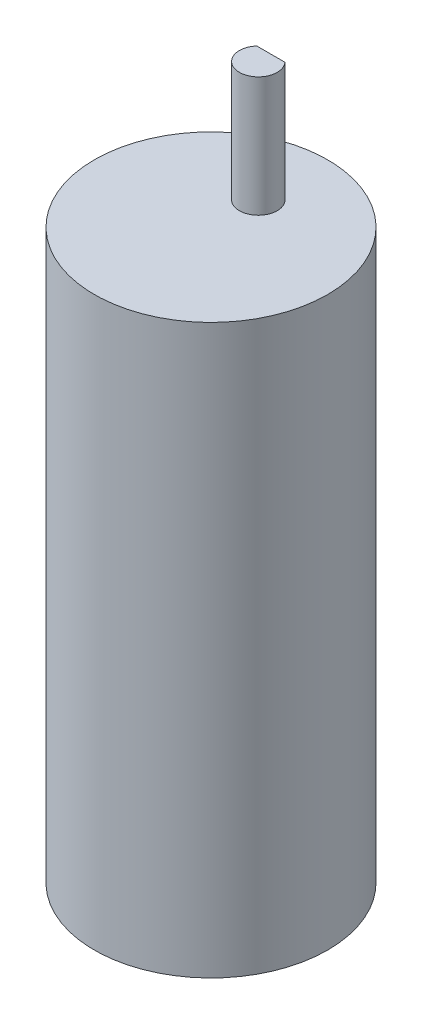
ISO-10303-21;
HEADER;
FILE_DESCRIPTION(('STEP AP214'),'2;1');
FILE_NAME('part.step','',(''),(''),'','','');
FILE_SCHEMA(('AUTOMOTIVE_DESIGN { 1 0 10303 214 1 1 1 1 }'));
ENDSEC;
DATA;
#1=APPLICATION_CONTEXT('core data for automotive mechanical design processes');
#2=APPLICATION_PROTOCOL_DEFINITION('international standard','automotive_design',2000,#1);
#3=PRODUCT_CONTEXT('',#1,'mechanical');
#4=PRODUCT('Part','Part','',(#3));
#5=PRODUCT_RELATED_PRODUCT_CATEGORY('part','',(#4));
#6=PRODUCT_DEFINITION_FORMATION('','',#4);
#7=PRODUCT_DEFINITION_CONTEXT('part definition',#1,'design');
#8=PRODUCT_DEFINITION('design','',#6,#7);
#9=PRODUCT_DEFINITION_SHAPE('','',#8);
#10=(LENGTH_UNIT() NAMED_UNIT(*) SI_UNIT(.MILLI.,.METRE.));
#11=(NAMED_UNIT(*) PLANE_ANGLE_UNIT() SI_UNIT($,.RADIAN.));
#12=(NAMED_UNIT(*) SI_UNIT($,.STERADIAN.) SOLID_ANGLE_UNIT());
#13=UNCERTAINTY_MEASURE_WITH_UNIT(LENGTH_MEASURE(1.E-05),#10,'distance_accuracy_value','');
#14=(GEOMETRIC_REPRESENTATION_CONTEXT(3) GLOBAL_UNCERTAINTY_ASSIGNED_CONTEXT((#13)) GLOBAL_UNIT_ASSIGNED_CONTEXT((#10,
#11,#12)) REPRESENTATION_CONTEXT('',''));
#15=CARTESIAN_POINT('',(0.,0.,0.));
#16=DIRECTION('',(0.,0.,1.));
#17=DIRECTION('',(1.,0.,0.));
#18=AXIS2_PLACEMENT_3D('',#15,#16,#17);
#19=CARTESIAN_POINT('',(0.,0.,0.));
#20=DIRECTION('',(0.,1.,0.));
#21=DIRECTION('',(-1.,0.,0.));
#22=AXIS2_PLACEMENT_3D('',#19,#20,#21);
#23=PLANE('',#22);
#24=CARTESIAN_POINT('',(0.,0.,0.));
#25=DIRECTION('',(0.,-1.,0.));
#26=DIRECTION('',(1.,0.,0.));
#27=AXIS2_PLACEMENT_3D('',#24,#25,#26);
#28=CIRCLE('',#27,18.5);
#29=CARTESIAN_POINT('',(18.5,0.,0.));
#30=VERTEX_POINT('',#29);
#31=EDGE_CURVE('E11',#30,#30,#28,.T.);
#32=ORIENTED_EDGE('',*,*,#31,.F.);
#33=EDGE_LOOP('',(#32));
#34=FACE_BOUND('',#33,.T.);
#35=DIRECTION('',(-1.,0.,0.));
#36=VECTOR('',#35,1.);
#37=CARTESIAN_POINT('',(-2.23606797749979,0.,-9.5));
#38=LINE('',#37,#36);
#39=CARTESIAN_POINT('',(2.23606797749979,0.,-9.5));
#40=VERTEX_POINT('',#39);
#41=CARTESIAN_POINT('',(-2.23606797749979,0.,-9.5));
#42=VERTEX_POINT('',#41);
#43=EDGE_CURVE('E61',#40,#42,#38,.T.);
#44=ORIENTED_EDGE('',*,*,#43,.F.);
#45=CARTESIAN_POINT('',(0.,0.,-7.5));
#46=DIRECTION('',(0.,1.,0.));
#47=DIRECTION('',(-1.,0.,0.));
#48=AXIS2_PLACEMENT_3D('',#45,#46,#47);
#49=CIRCLE('',#48,3.);
#50=EDGE_CURVE('E46',#42,#40,#49,.T.);
#51=ORIENTED_EDGE('',*,*,#50,.F.);
#52=EDGE_LOOP('',(#44,#51));
#53=FACE_BOUND('',#52,.T.);
#54=ADVANCED_FACE('F32',(#34,#53),#23,.T.);
#55=CARTESIAN_POINT('',(0.,-90.,0.));
#56=DIRECTION('',(0.,-1.,0.));
#57=DIRECTION('',(1.,0.,0.));
#58=AXIS2_PLACEMENT_3D('',#55,#56,#57);
#59=CYLINDRICAL_SURFACE('',#58,18.5);
#60=ORIENTED_EDGE('',*,*,#31,.T.);
#61=EDGE_LOOP('',(#60));
#62=FACE_BOUND('',#61,.T.);
#63=CARTESIAN_POINT('',(0.,-90.,0.));
#64=DIRECTION('',(0.,-1.,0.));
#65=DIRECTION('',(1.,0.,0.));
#66=AXIS2_PLACEMENT_3D('',#63,#64,#65);
#67=CIRCLE('',#66,18.5);
#68=CARTESIAN_POINT('',(18.5,-90.,0.));
#69=VERTEX_POINT('',#68);
#70=EDGE_CURVE('E39',#69,#69,#67,.T.);
#71=ORIENTED_EDGE('',*,*,#70,.F.);
#72=EDGE_LOOP('',(#71));
#73=FACE_BOUND('',#72,.T.);
#74=ADVANCED_FACE('F80',(#62,#73),#59,.T.);
#75=CARTESIAN_POINT('',(18.5,-90.,0.));
#76=DIRECTION('',(0.,-1.,0.));
#77=DIRECTION('',(1.,0.,0.));
#78=AXIS2_PLACEMENT_3D('',#75,#76,#77);
#79=PLANE('',#78);
#80=ORIENTED_EDGE('',*,*,#70,.T.);
#81=EDGE_LOOP('',(#80));
#82=FACE_BOUND('',#81,.T.);
#83=ADVANCED_FACE('F78',(#82),#79,.T.);
#84=CARTESIAN_POINT('',(0.,19.,-7.5));
#85=DIRECTION('',(0.,-1.,0.));
#86=DIRECTION('',(1.,0.,0.));
#87=AXIS2_PLACEMENT_3D('',#84,#85,#86);
#88=CYLINDRICAL_SURFACE('',#87,3.);
#89=ORIENTED_EDGE('',*,*,#50,.T.);
#90=DIRECTION('',(0.,-1.,0.));
#91=VECTOR('',#90,1.);
#92=CARTESIAN_POINT('',(2.23606797749979,19.,-9.5));
#93=LINE('',#92,#91);
#94=CARTESIAN_POINT('',(2.23606797749979,19.,-9.5));
#95=VERTEX_POINT('',#94);
#96=EDGE_CURVE('E65',#95,#40,#93,.T.);
#97=ORIENTED_EDGE('',*,*,#96,.F.);
#98=CARTESIAN_POINT('',(0.,19.,-7.5));
#99=DIRECTION('',(0.,1.,0.));
#100=DIRECTION('',(-1.,0.,0.));
#101=AXIS2_PLACEMENT_3D('',#98,#99,#100);
#102=CIRCLE('',#101,3.);
#103=CARTESIAN_POINT('',(-2.23606797749979,19.,-9.5));
#104=VERTEX_POINT('',#103);
#105=EDGE_CURVE('E67',#104,#95,#102,.T.);
#106=ORIENTED_EDGE('',*,*,#105,.F.);
#107=DIRECTION('',(0.,-1.,0.));
#108=VECTOR('',#107,1.);
#109=CARTESIAN_POINT('',(-2.23606797749979,19.,-9.5));
#110=LINE('',#109,#108);
#111=EDGE_CURVE('E63',#104,#42,#110,.T.);
#112=ORIENTED_EDGE('',*,*,#111,.T.);
#113=EDGE_LOOP('',(#89,#97,#106,#112));
#114=FACE_BOUND('',#113,.T.);
#115=ADVANCED_FACE('F69',(#114),#88,.T.);
#116=CARTESIAN_POINT('',(-2.23606797749979,19.,-9.5));
#117=DIRECTION('',(0.,0.,1.));
#118=DIRECTION('',(1.,0.,0.));
#119=AXIS2_PLACEMENT_3D('',#116,#117,#118);
#120=PLANE('',#119);
#121=ORIENTED_EDGE('',*,*,#43,.T.);
#122=ORIENTED_EDGE('',*,*,#111,.F.);
#123=DIRECTION('',(-1.,0.,0.));
#124=VECTOR('',#123,1.);
#125=CARTESIAN_POINT('',(-2.23606797749979,19.,-9.5));
#126=LINE('',#125,#124);
#127=EDGE_CURVE('E54',#95,#104,#126,.T.);
#128=ORIENTED_EDGE('',*,*,#127,.F.);
#129=ORIENTED_EDGE('',*,*,#96,.T.);
#130=EDGE_LOOP('',(#121,#122,#128,#129));
#131=FACE_BOUND('',#130,.T.);
#132=ADVANCED_FACE('F62',(#131),#120,.F.);
#133=CARTESIAN_POINT('',(0.,19.,-7.5));
#134=DIRECTION('',(0.,1.,0.));
#135=DIRECTION('',(-1.,0.,0.));
#136=AXIS2_PLACEMENT_3D('',#133,#134,#135);
#137=PLANE('',#136);
#138=ORIENTED_EDGE('',*,*,#105,.T.);
#139=ORIENTED_EDGE('',*,*,#127,.T.);
#140=EDGE_LOOP('',(#138,#139));
#141=FACE_BOUND('',#140,.T.);
#142=ADVANCED_FACE('F94',(#141),#137,.T.);
#143=CLOSED_SHELL('',(#54,#74,#83,#115,#132,#142));
#144=MANIFOLD_SOLID_BREP('B2',#143);
#145=ADVANCED_BREP_SHAPE_REPRESENTATION('',(#18,#144),#14);
#146=SHAPE_DEFINITION_REPRESENTATION(#9,#145);
ENDSEC;
END-ISO-10303-21;
